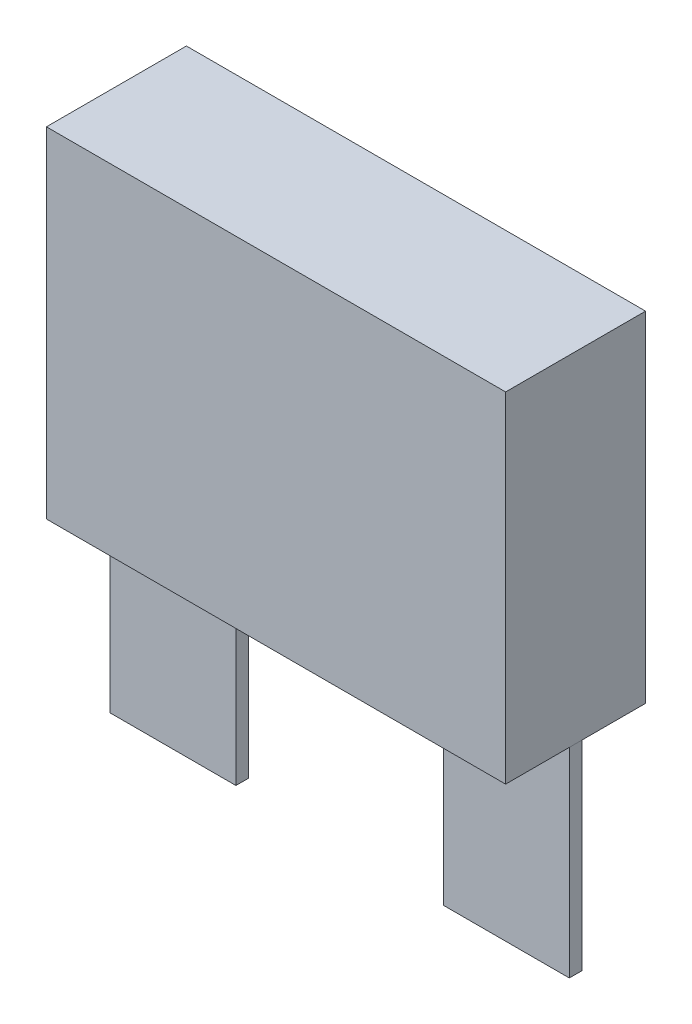
ISO-10303-21;
HEADER;
FILE_DESCRIPTION(('STEP AP214'),'2;1');
FILE_NAME('part.step','',(''),(''),'','','');
FILE_SCHEMA(('AUTOMOTIVE_DESIGN { 1 0 10303 214 1 1 1 1 }'));
ENDSEC;
DATA;
#1=APPLICATION_CONTEXT('core data for automotive mechanical design processes');
#2=APPLICATION_PROTOCOL_DEFINITION('international standard','automotive_design',2000,#1);
#3=PRODUCT_CONTEXT('',#1,'mechanical');
#4=PRODUCT('Part','Part','',(#3));
#5=PRODUCT_RELATED_PRODUCT_CATEGORY('part','',(#4));
#6=PRODUCT_DEFINITION_FORMATION('','',#4);
#7=PRODUCT_DEFINITION_CONTEXT('part definition',#1,'design');
#8=PRODUCT_DEFINITION('design','',#6,#7);
#9=PRODUCT_DEFINITION_SHAPE('','',#8);
#10=(LENGTH_UNIT() NAMED_UNIT(*) SI_UNIT(.MILLI.,.METRE.));
#11=(NAMED_UNIT(*) PLANE_ANGLE_UNIT() SI_UNIT($,.RADIAN.));
#12=(NAMED_UNIT(*) SI_UNIT($,.STERADIAN.) SOLID_ANGLE_UNIT());
#13=UNCERTAINTY_MEASURE_WITH_UNIT(LENGTH_MEASURE(1.E-05),#10,'distance_accuracy_value','');
#14=(GEOMETRIC_REPRESENTATION_CONTEXT(3) GLOBAL_UNCERTAINTY_ASSIGNED_CONTEXT((#13)) GLOBAL_UNIT_ASSIGNED_CONTEXT((#10,
#11,#12)) REPRESENTATION_CONTEXT('',''));
#15=CARTESIAN_POINT('',(0.,0.,0.));
#16=DIRECTION('',(0.,0.,1.));
#17=DIRECTION('',(1.,0.,0.));
#18=AXIS2_PLACEMENT_3D('',#15,#16,#17);
#19=CARTESIAN_POINT('',(14.6,-12.7,-0.399999999999999));
#20=DIRECTION('',(-1.,0.,0.));
#21=DIRECTION('',(0.,0.,1.));
#22=AXIS2_PLACEMENT_3D('',#19,#20,#21);
#23=PLANE('',#22);
#24=DIRECTION('',(0.,0.,1.));
#25=VECTOR('',#24,1.);
#26=CARTESIAN_POINT('',(14.6,0.,-0.399999999999999));
#27=LINE('',#26,#25);
#28=CARTESIAN_POINT('',(14.6,0.,-0.399999999999999));
#29=VERTEX_POINT('',#28);
#30=CARTESIAN_POINT('',(14.6,0.,0.399999999999999));
#31=VERTEX_POINT('',#30);
#32=EDGE_CURVE('E12',#29,#31,#27,.T.);
#33=ORIENTED_EDGE('',*,*,#32,.T.);
#34=DIRECTION('',(0.,1.,0.));
#35=VECTOR('',#34,1.);
#36=CARTESIAN_POINT('',(14.6,-12.7,0.399999999999999));
#37=LINE('',#36,#35);
#38=CARTESIAN_POINT('',(14.6,-12.7,0.399999999999999));
#39=VERTEX_POINT('',#38);
#40=EDGE_CURVE('E125',#39,#31,#37,.T.);
#41=ORIENTED_EDGE('',*,*,#40,.F.);
#42=DIRECTION('',(0.,0.,1.));
#43=VECTOR('',#42,1.);
#44=CARTESIAN_POINT('',(14.6,-12.7,-0.399999999999999));
#45=LINE('',#44,#43);
#46=CARTESIAN_POINT('',(14.6,-12.7,-0.399999999999999));
#47=VERTEX_POINT('',#46);
#48=EDGE_CURVE('E58',#47,#39,#45,.T.);
#49=ORIENTED_EDGE('',*,*,#48,.F.);
#50=DIRECTION('',(0.,1.,0.));
#51=VECTOR('',#50,1.);
#52=CARTESIAN_POINT('',(14.6,-12.7,-0.399999999999999));
#53=LINE('',#52,#51);
#54=EDGE_CURVE('E113',#47,#29,#53,.T.);
#55=ORIENTED_EDGE('',*,*,#54,.T.);
#56=EDGE_LOOP('',(#33,#41,#49,#55));
#57=FACE_BOUND('',#56,.T.);
#58=ADVANCED_FACE('F54',(#57),#23,.F.);
#59=CARTESIAN_POINT('',(14.6,-12.7,0.399999999999999));
#60=DIRECTION('',(0.,0.,-1.));
#61=DIRECTION('',(-1.,0.,0.));
#62=AXIS2_PLACEMENT_3D('',#59,#60,#61);
#63=PLANE('',#62);
#64=DIRECTION('',(-1.,0.,0.));
#65=VECTOR('',#64,1.);
#66=CARTESIAN_POINT('',(14.6,0.,0.399999999999999));
#67=LINE('',#66,#65);
#68=CARTESIAN_POINT('',(6.6,0.,0.399999999999999));
#69=VERTEX_POINT('',#68);
#70=EDGE_CURVE('E64',#31,#69,#67,.T.);
#71=ORIENTED_EDGE('',*,*,#70,.T.);
#72=DIRECTION('',(0.,1.,0.));
#73=VECTOR('',#72,1.);
#74=CARTESIAN_POINT('',(6.6,-12.7,0.399999999999999));
#75=LINE('',#74,#73);
#76=CARTESIAN_POINT('',(6.6,-12.7,0.399999999999999));
#77=VERTEX_POINT('',#76);
#78=EDGE_CURVE('E109',#77,#69,#75,.T.);
#79=ORIENTED_EDGE('',*,*,#78,.F.);
#80=DIRECTION('',(-1.,0.,0.));
#81=VECTOR('',#80,1.);
#82=CARTESIAN_POINT('',(14.6,-12.7,0.399999999999999));
#83=LINE('',#82,#81);
#84=EDGE_CURVE('E88',#39,#77,#83,.T.);
#85=ORIENTED_EDGE('',*,*,#84,.F.);
#86=ORIENTED_EDGE('',*,*,#40,.T.);
#87=EDGE_LOOP('',(#71,#79,#85,#86));
#88=FACE_BOUND('',#87,.T.);
#89=ADVANCED_FACE('F128',(#88),#63,.F.);
#90=CARTESIAN_POINT('',(6.6,-12.7,-0.400000000000001));
#91=DIRECTION('',(1.,0.,0.));
#92=DIRECTION('',(0.,0.,-1.));
#93=AXIS2_PLACEMENT_3D('',#90,#91,#92);
#94=PLANE('',#93);
#95=DIRECTION('',(0.,0.,-1.));
#96=VECTOR('',#95,1.);
#97=CARTESIAN_POINT('',(6.6,0.,-0.400000000000001));
#98=LINE('',#97,#96);
#99=CARTESIAN_POINT('',(6.6,0.,-0.400000000000001));
#100=VERTEX_POINT('',#99);
#101=EDGE_CURVE('E104',#69,#100,#98,.T.);
#102=ORIENTED_EDGE('',*,*,#101,.T.);
#103=DIRECTION('',(0.,1.,0.));
#104=VECTOR('',#103,1.);
#105=CARTESIAN_POINT('',(6.6,-12.7,-0.400000000000001));
#106=LINE('',#105,#104);
#107=CARTESIAN_POINT('',(6.6,-12.7,-0.400000000000001));
#108=VERTEX_POINT('',#107);
#109=EDGE_CURVE('E107',#108,#100,#106,.T.);
#110=ORIENTED_EDGE('',*,*,#109,.F.);
#111=DIRECTION('',(0.,0.,-1.));
#112=VECTOR('',#111,1.);
#113=CARTESIAN_POINT('',(6.6,-12.7,-0.400000000000001));
#114=LINE('',#113,#112);
#115=EDGE_CURVE('E121',#77,#108,#114,.T.);
#116=ORIENTED_EDGE('',*,*,#115,.F.);
#117=ORIENTED_EDGE('',*,*,#78,.T.);
#118=EDGE_LOOP('',(#102,#110,#116,#117));
#119=FACE_BOUND('',#118,.T.);
#120=ADVANCED_FACE('F105',(#119),#94,.F.);
#121=CARTESIAN_POINT('',(14.6,-12.7,-0.399999999999999));
#122=DIRECTION('',(0.,0.,1.));
#123=DIRECTION('',(1.,0.,0.));
#124=AXIS2_PLACEMENT_3D('',#121,#122,#123);
#125=PLANE('',#124);
#126=DIRECTION('',(1.,0.,0.));
#127=VECTOR('',#126,1.);
#128=CARTESIAN_POINT('',(14.6,0.,-0.399999999999999));
#129=LINE('',#128,#127);
#130=EDGE_CURVE('E98',#100,#29,#129,.T.);
#131=ORIENTED_EDGE('',*,*,#130,.T.);
#132=ORIENTED_EDGE('',*,*,#54,.F.);
#133=DIRECTION('',(1.,0.,0.));
#134=VECTOR('',#133,1.);
#135=CARTESIAN_POINT('',(14.6,-12.7,-0.399999999999999));
#136=LINE('',#135,#134);
#137=EDGE_CURVE('E112',#108,#47,#136,.T.);
#138=ORIENTED_EDGE('',*,*,#137,.F.);
#139=ORIENTED_EDGE('',*,*,#109,.T.);
#140=EDGE_LOOP('',(#131,#132,#138,#139));
#141=FACE_BOUND('',#140,.T.);
#142=ADVANCED_FACE('F111',(#141),#125,.F.);
#143=CARTESIAN_POINT('',(0.,-12.7,0.));
#144=DIRECTION('',(0.,-1.,0.));
#145=DIRECTION('',(0.,0.,-1.));
#146=AXIS2_PLACEMENT_3D('',#143,#144,#145);
#147=PLANE('',#146);
#148=ORIENTED_EDGE('',*,*,#48,.T.);
#149=ORIENTED_EDGE('',*,*,#84,.T.);
#150=ORIENTED_EDGE('',*,*,#115,.T.);
#151=ORIENTED_EDGE('',*,*,#137,.T.);
#152=EDGE_LOOP('',(#148,#149,#150,#151));
#153=FACE_BOUND('',#152,.T.);
#154=ADVANCED_FACE('F56',(#153),#147,.T.);
#155=CARTESIAN_POINT('',(0.,0.,0.));
#156=DIRECTION('',(0.,-1.,0.));
#157=DIRECTION('',(0.,0.,-1.));
#158=AXIS2_PLACEMENT_3D('',#155,#156,#157);
#159=PLANE('',#158);
#160=ORIENTED_EDGE('',*,*,#32,.F.);
#161=ORIENTED_EDGE('',*,*,#130,.F.);
#162=ORIENTED_EDGE('',*,*,#101,.F.);
#163=ORIENTED_EDGE('',*,*,#70,.F.);
#164=EDGE_LOOP('',(#160,#161,#162,#163));
#165=FACE_BOUND('',#164,.T.);
#166=ADVANCED_FACE('F115',(#165),#159,.F.);
#167=CLOSED_SHELL('',(#58,#89,#120,#142,#154,#166));
#168=MANIFOLD_SOLID_BREP('B2',#167);
#169=CARTESIAN_POINT('',(-14.6,-12.7,-0.4));
#170=DIRECTION('',(1.,0.,0.));
#171=DIRECTION('',(0.,0.,-1.));
#172=AXIS2_PLACEMENT_3D('',#169,#170,#171);
#173=PLANE('',#172);
#174=DIRECTION('',(0.,0.,-1.));
#175=VECTOR('',#174,1.);
#176=CARTESIAN_POINT('',(-14.6,0.,-0.4));
#177=LINE('',#176,#175);
#178=CARTESIAN_POINT('',(-14.6,0.,0.4));
#179=VERTEX_POINT('',#178);
#180=CARTESIAN_POINT('',(-14.6,0.,-0.4));
#181=VERTEX_POINT('',#180);
#182=EDGE_CURVE('E250',#179,#181,#177,.T.);
#183=ORIENTED_EDGE('',*,*,#182,.T.);
#184=DIRECTION('',(0.,1.,0.));
#185=VECTOR('',#184,1.);
#186=CARTESIAN_POINT('',(-14.6,-12.7,-0.4));
#187=LINE('',#186,#185);
#188=CARTESIAN_POINT('',(-14.6,-12.7,-0.4));
#189=VERTEX_POINT('',#188);
#190=EDGE_CURVE('E52',#189,#181,#187,.T.);
#191=ORIENTED_EDGE('',*,*,#190,.F.);
#192=DIRECTION('',(0.,0.,-1.));
#193=VECTOR('',#192,1.);
#194=CARTESIAN_POINT('',(-14.6,-12.7,-0.4));
#195=LINE('',#194,#193);
#196=CARTESIAN_POINT('',(-14.6,-12.7,0.4));
#197=VERTEX_POINT('',#196);
#198=EDGE_CURVE('E238',#197,#189,#195,.T.);
#199=ORIENTED_EDGE('',*,*,#198,.F.);
#200=DIRECTION('',(0.,1.,0.));
#201=VECTOR('',#200,1.);
#202=CARTESIAN_POINT('',(-14.6,-12.7,0.4));
#203=LINE('',#202,#201);
#204=EDGE_CURVE('E246',#197,#179,#203,.T.);
#205=ORIENTED_EDGE('',*,*,#204,.T.);
#206=EDGE_LOOP('',(#183,#191,#199,#205));
#207=FACE_BOUND('',#206,.T.);
#208=ADVANCED_FACE('F187',(#207),#173,.F.);
#209=CARTESIAN_POINT('',(-14.6,-12.7,-0.4));
#210=DIRECTION('',(0.,0.,1.));
#211=DIRECTION('',(1.,0.,0.));
#212=AXIS2_PLACEMENT_3D('',#209,#210,#211);
#213=PLANE('',#212);
#214=DIRECTION('',(1.,0.,0.));
#215=VECTOR('',#214,1.);
#216=CARTESIAN_POINT('',(-14.6,0.,-0.4));
#217=LINE('',#216,#215);
#218=CARTESIAN_POINT('',(-6.6,0.,-0.4));
#219=VERTEX_POINT('',#218);
#220=EDGE_CURVE('E242',#181,#219,#217,.T.);
#221=ORIENTED_EDGE('',*,*,#220,.T.);
#222=DIRECTION('',(0.,1.,0.));
#223=VECTOR('',#222,1.);
#224=CARTESIAN_POINT('',(-6.6,-12.7,-0.4));
#225=LINE('',#224,#223);
#226=CARTESIAN_POINT('',(-6.6,-12.7,-0.4));
#227=VERTEX_POINT('',#226);
#228=EDGE_CURVE('E195',#227,#219,#225,.T.);
#229=ORIENTED_EDGE('',*,*,#228,.F.);
#230=DIRECTION('',(1.,0.,0.));
#231=VECTOR('',#230,1.);
#232=CARTESIAN_POINT('',(-14.6,-12.7,-0.4));
#233=LINE('',#232,#231);
#234=EDGE_CURVE('E233',#189,#227,#233,.T.);
#235=ORIENTED_EDGE('',*,*,#234,.F.);
#236=ORIENTED_EDGE('',*,*,#190,.T.);
#237=EDGE_LOOP('',(#221,#229,#235,#236));
#238=FACE_BOUND('',#237,.T.);
#239=ADVANCED_FACE('F241',(#238),#213,.F.);
#240=CARTESIAN_POINT('',(-6.6,-12.7,-0.4));
#241=DIRECTION('',(-1.,0.,0.));
#242=DIRECTION('',(0.,0.,1.));
#243=AXIS2_PLACEMENT_3D('',#240,#241,#242);
#244=PLANE('',#243);
#245=DIRECTION('',(0.,0.,1.));
#246=VECTOR('',#245,1.);
#247=CARTESIAN_POINT('',(-6.6,0.,-0.4));
#248=LINE('',#247,#246);
#249=CARTESIAN_POINT('',(-6.6,0.,0.4));
#250=VERTEX_POINT('',#249);
#251=EDGE_CURVE('E220',#219,#250,#248,.T.);
#252=ORIENTED_EDGE('',*,*,#251,.T.);
#253=DIRECTION('',(0.,1.,0.));
#254=VECTOR('',#253,1.);
#255=CARTESIAN_POINT('',(-6.6,-12.7,0.4));
#256=LINE('',#255,#254);
#257=CARTESIAN_POINT('',(-6.6,-12.7,0.4));
#258=VERTEX_POINT('',#257);
#259=EDGE_CURVE('E243',#258,#250,#256,.T.);
#260=ORIENTED_EDGE('',*,*,#259,.F.);
#261=DIRECTION('',(0.,0.,1.));
#262=VECTOR('',#261,1.);
#263=CARTESIAN_POINT('',(-6.6,-12.7,-0.4));
#264=LINE('',#263,#262);
#265=EDGE_CURVE('E236',#227,#258,#264,.T.);
#266=ORIENTED_EDGE('',*,*,#265,.F.);
#267=ORIENTED_EDGE('',*,*,#228,.T.);
#268=EDGE_LOOP('',(#252,#260,#266,#267));
#269=FACE_BOUND('',#268,.T.);
#270=ADVANCED_FACE('F244',(#269),#244,.F.);
#271=CARTESIAN_POINT('',(-14.6,-12.7,0.4));
#272=DIRECTION('',(0.,0.,-1.));
#273=DIRECTION('',(-1.,0.,0.));
#274=AXIS2_PLACEMENT_3D('',#271,#272,#273);
#275=PLANE('',#274);
#276=DIRECTION('',(-1.,0.,0.));
#277=VECTOR('',#276,1.);
#278=CARTESIAN_POINT('',(-14.6,0.,0.4));
#279=LINE('',#278,#277);
#280=EDGE_CURVE('E226',#250,#179,#279,.T.);
#281=ORIENTED_EDGE('',*,*,#280,.T.);
#282=ORIENTED_EDGE('',*,*,#204,.F.);
#283=DIRECTION('',(-1.,0.,0.));
#284=VECTOR('',#283,1.);
#285=CARTESIAN_POINT('',(-14.6,-12.7,0.4));
#286=LINE('',#285,#284);
#287=EDGE_CURVE('E203',#258,#197,#286,.T.);
#288=ORIENTED_EDGE('',*,*,#287,.F.);
#289=ORIENTED_EDGE('',*,*,#259,.T.);
#290=EDGE_LOOP('',(#281,#282,#288,#289));
#291=FACE_BOUND('',#290,.T.);
#292=ADVANCED_FACE('F257',(#291),#275,.F.);
#293=CARTESIAN_POINT('',(0.,-12.7,0.));
#294=DIRECTION('',(0.,1.,0.));
#295=DIRECTION('',(0.,0.,1.));
#296=AXIS2_PLACEMENT_3D('',#293,#294,#295);
#297=PLANE('',#296);
#298=ORIENTED_EDGE('',*,*,#198,.T.);
#299=ORIENTED_EDGE('',*,*,#234,.T.);
#300=ORIENTED_EDGE('',*,*,#265,.T.);
#301=ORIENTED_EDGE('',*,*,#287,.T.);
#302=EDGE_LOOP('',(#298,#299,#300,#301));
#303=FACE_BOUND('',#302,.T.);
#304=ADVANCED_FACE('F234',(#303),#297,.F.);
#305=CARTESIAN_POINT('',(0.,0.,0.));
#306=DIRECTION('',(0.,1.,0.));
#307=DIRECTION('',(0.,0.,1.));
#308=AXIS2_PLACEMENT_3D('',#305,#306,#307);
#309=PLANE('',#308);
#310=ORIENTED_EDGE('',*,*,#182,.F.);
#311=ORIENTED_EDGE('',*,*,#280,.F.);
#312=ORIENTED_EDGE('',*,*,#251,.F.);
#313=ORIENTED_EDGE('',*,*,#220,.F.);
#314=EDGE_LOOP('',(#310,#311,#312,#313));
#315=FACE_BOUND('',#314,.T.);
#316=ADVANCED_FACE('F260',(#315),#309,.T.);
#317=CLOSED_SHELL('',(#208,#239,#270,#292,#304,#316));
#318=MANIFOLD_SOLID_BREP('B6',#317);
#319=CARTESIAN_POINT('',(14.6,21.6,4.45));
#320=DIRECTION('',(-1.,0.,0.));
#321=DIRECTION('',(0.,0.,1.));
#322=AXIS2_PLACEMENT_3D('',#319,#320,#321);
#323=PLANE('',#322);
#324=DIRECTION('',(0.,0.,-1.));
#325=VECTOR('',#324,1.);
#326=CARTESIAN_POINT('',(14.6,0.,4.45));
#327=LINE('',#326,#325);
#328=CARTESIAN_POINT('',(14.6,0.,4.45));
#329=VERTEX_POINT('',#328);
#330=CARTESIAN_POINT('',(14.6,0.,-4.45));
#331=VERTEX_POINT('',#330);
#332=EDGE_CURVE('E374',#329,#331,#327,.T.);
#333=ORIENTED_EDGE('',*,*,#332,.T.);
#334=DIRECTION('',(0.,-1.,0.));
#335=VECTOR('',#334,1.);
#336=CARTESIAN_POINT('',(14.6,21.6,-4.45));
#337=LINE('',#336,#335);
#338=CARTESIAN_POINT('',(14.6,21.6,-4.45));
#339=VERTEX_POINT('',#338);
#340=EDGE_CURVE('E185',#339,#331,#337,.T.);
#341=ORIENTED_EDGE('',*,*,#340,.F.);
#342=DIRECTION('',(0.,0.,-1.));
#343=VECTOR('',#342,1.);
#344=CARTESIAN_POINT('',(14.6,21.6,4.45));
#345=LINE('',#344,#343);
#346=CARTESIAN_POINT('',(14.6,21.6,4.45));
#347=VERTEX_POINT('',#346);
#348=EDGE_CURVE('E362',#347,#339,#345,.T.);
#349=ORIENTED_EDGE('',*,*,#348,.F.);
#350=DIRECTION('',(0.,-1.,0.));
#351=VECTOR('',#350,1.);
#352=CARTESIAN_POINT('',(14.6,21.6,4.45));
#353=LINE('',#352,#351);
#354=EDGE_CURVE('E370',#347,#329,#353,.T.);
#355=ORIENTED_EDGE('',*,*,#354,.T.);
#356=EDGE_LOOP('',(#333,#341,#349,#355));
#357=FACE_BOUND('',#356,.T.);
#358=ADVANCED_FACE('F311',(#357),#323,.F.);
#359=CARTESIAN_POINT('',(-14.6,21.6,-4.45));
#360=DIRECTION('',(0.,0.,1.));
#361=DIRECTION('',(1.,0.,0.));
#362=AXIS2_PLACEMENT_3D('',#359,#360,#361);
#363=PLANE('',#362);
#364=DIRECTION('',(-1.,0.,0.));
#365=VECTOR('',#364,1.);
#366=CARTESIAN_POINT('',(-14.6,0.,-4.45));
#367=LINE('',#366,#365);
#368=CARTESIAN_POINT('',(-14.6,0.,-4.45));
#369=VERTEX_POINT('',#368);
#370=EDGE_CURVE('E366',#331,#369,#367,.T.);
#371=ORIENTED_EDGE('',*,*,#370,.T.);
#372=DIRECTION('',(0.,-1.,0.));
#373=VECTOR('',#372,1.);
#374=CARTESIAN_POINT('',(-14.6,21.6,-4.45));
#375=LINE('',#374,#373);
#376=CARTESIAN_POINT('',(-14.6,21.6,-4.45));
#377=VERTEX_POINT('',#376);
#378=EDGE_CURVE('E319',#377,#369,#375,.T.);
#379=ORIENTED_EDGE('',*,*,#378,.F.);
#380=DIRECTION('',(-1.,0.,0.));
#381=VECTOR('',#380,1.);
#382=CARTESIAN_POINT('',(-14.6,21.6,-4.45));
#383=LINE('',#382,#381);
#384=EDGE_CURVE('E357',#339,#377,#383,.T.);
#385=ORIENTED_EDGE('',*,*,#384,.F.);
#386=ORIENTED_EDGE('',*,*,#340,.T.);
#387=EDGE_LOOP('',(#371,#379,#385,#386));
#388=FACE_BOUND('',#387,.T.);
#389=ADVANCED_FACE('F365',(#388),#363,.F.);
#390=CARTESIAN_POINT('',(-14.6,21.6,4.45));
#391=DIRECTION('',(1.,0.,0.));
#392=DIRECTION('',(0.,0.,-1.));
#393=AXIS2_PLACEMENT_3D('',#390,#391,#392);
#394=PLANE('',#393);
#395=DIRECTION('',(0.,0.,1.));
#396=VECTOR('',#395,1.);
#397=CARTESIAN_POINT('',(-14.6,0.,4.45));
#398=LINE('',#397,#396);
#399=CARTESIAN_POINT('',(-14.6,0.,4.45));
#400=VERTEX_POINT('',#399);
#401=EDGE_CURVE('E344',#369,#400,#398,.T.);
#402=ORIENTED_EDGE('',*,*,#401,.T.);
#403=DIRECTION('',(0.,-1.,0.));
#404=VECTOR('',#403,1.);
#405=CARTESIAN_POINT('',(-14.6,21.6,4.45));
#406=LINE('',#405,#404);
#407=CARTESIAN_POINT('',(-14.6,21.6,4.45));
#408=VERTEX_POINT('',#407);
#409=EDGE_CURVE('E367',#408,#400,#406,.T.);
#410=ORIENTED_EDGE('',*,*,#409,.F.);
#411=DIRECTION('',(0.,0.,1.));
#412=VECTOR('',#411,1.);
#413=CARTESIAN_POINT('',(-14.6,21.6,4.45));
#414=LINE('',#413,#412);
#415=EDGE_CURVE('E360',#377,#408,#414,.T.);
#416=ORIENTED_EDGE('',*,*,#415,.F.);
#417=ORIENTED_EDGE('',*,*,#378,.T.);
#418=EDGE_LOOP('',(#402,#410,#416,#417));
#419=FACE_BOUND('',#418,.T.);
#420=ADVANCED_FACE('F368',(#419),#394,.F.);
#421=CARTESIAN_POINT('',(-14.6,21.6,4.45));
#422=DIRECTION('',(0.,0.,-1.));
#423=DIRECTION('',(-1.,0.,0.));
#424=AXIS2_PLACEMENT_3D('',#421,#422,#423);
#425=PLANE('',#424);
#426=DIRECTION('',(1.,0.,0.));
#427=VECTOR('',#426,1.);
#428=CARTESIAN_POINT('',(-14.6,0.,4.45));
#429=LINE('',#428,#427);
#430=EDGE_CURVE('E350',#400,#329,#429,.T.);
#431=ORIENTED_EDGE('',*,*,#430,.T.);
#432=ORIENTED_EDGE('',*,*,#354,.F.);
#433=DIRECTION('',(1.,0.,0.));
#434=VECTOR('',#433,1.);
#435=CARTESIAN_POINT('',(-14.6,21.6,4.45));
#436=LINE('',#435,#434);
#437=EDGE_CURVE('E327',#408,#347,#436,.T.);
#438=ORIENTED_EDGE('',*,*,#437,.F.);
#439=ORIENTED_EDGE('',*,*,#409,.T.);
#440=EDGE_LOOP('',(#431,#432,#438,#439));
#441=FACE_BOUND('',#440,.T.);
#442=ADVANCED_FACE('F381',(#441),#425,.F.);
#443=CARTESIAN_POINT('',(0.,21.6,0.));
#444=DIRECTION('',(0.,-1.,0.));
#445=DIRECTION('',(0.,0.,-1.));
#446=AXIS2_PLACEMENT_3D('',#443,#444,#445);
#447=PLANE('',#446);
#448=ORIENTED_EDGE('',*,*,#348,.T.);
#449=ORIENTED_EDGE('',*,*,#384,.T.);
#450=ORIENTED_EDGE('',*,*,#415,.T.);
#451=ORIENTED_EDGE('',*,*,#437,.T.);
#452=EDGE_LOOP('',(#448,#449,#450,#451));
#453=FACE_BOUND('',#452,.T.);
#454=ADVANCED_FACE('F358',(#453),#447,.F.);
#455=CARTESIAN_POINT('',(0.,0.,0.));
#456=DIRECTION('',(0.,-1.,0.));
#457=DIRECTION('',(0.,0.,-1.));
#458=AXIS2_PLACEMENT_3D('',#455,#456,#457);
#459=PLANE('',#458);
#460=ORIENTED_EDGE('',*,*,#332,.F.);
#461=ORIENTED_EDGE('',*,*,#430,.F.);
#462=ORIENTED_EDGE('',*,*,#401,.F.);
#463=ORIENTED_EDGE('',*,*,#370,.F.);
#464=EDGE_LOOP('',(#460,#461,#462,#463));
#465=FACE_BOUND('',#464,.T.);
#466=ADVANCED_FACE('F384',(#465),#459,.T.);
#467=CLOSED_SHELL('',(#358,#389,#420,#442,#454,#466));
#468=MANIFOLD_SOLID_BREP('B46',#467);
#469=ADVANCED_BREP_SHAPE_REPRESENTATION('',(#18,#168,#318,#468),#14);
#470=SHAPE_DEFINITION_REPRESENTATION(#9,#469);
ENDSEC;
END-ISO-10303-21;
